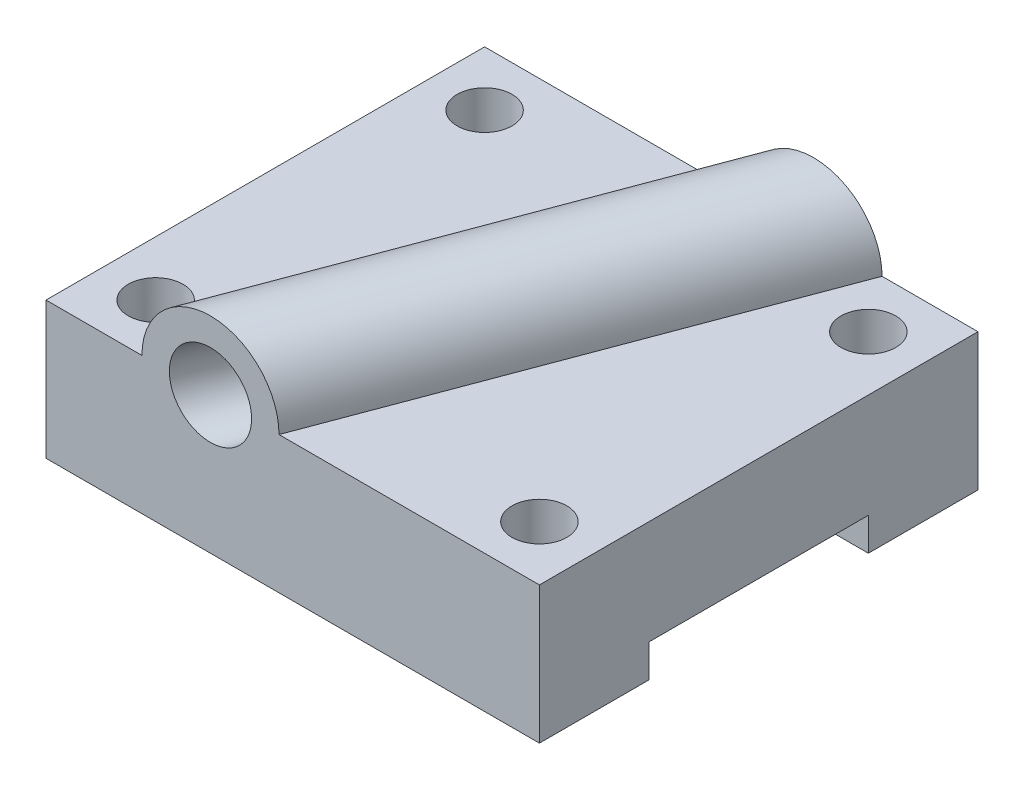
ISO-10303-21;
HEADER;
FILE_DESCRIPTION(('STEP AP214'),'2;1');
FILE_NAME('part.step','',(''),(''),'','','');
FILE_SCHEMA(('AUTOMOTIVE_DESIGN { 1 0 10303 214 1 1 1 1 }'));
ENDSEC;
DATA;
#1=APPLICATION_CONTEXT('core data for automotive mechanical design processes');
#2=APPLICATION_PROTOCOL_DEFINITION('international standard','automotive_design',2000,#1);
#3=PRODUCT_CONTEXT('',#1,'mechanical');
#4=PRODUCT('Part','Part','',(#3));
#5=PRODUCT_RELATED_PRODUCT_CATEGORY('part','',(#4));
#6=PRODUCT_DEFINITION_FORMATION('','',#4);
#7=PRODUCT_DEFINITION_CONTEXT('part definition',#1,'design');
#8=PRODUCT_DEFINITION('design','',#6,#7);
#9=PRODUCT_DEFINITION_SHAPE('','',#8);
#10=(LENGTH_UNIT() NAMED_UNIT(*) SI_UNIT(.MILLI.,.METRE.));
#11=(NAMED_UNIT(*) PLANE_ANGLE_UNIT() SI_UNIT($,.RADIAN.));
#12=(NAMED_UNIT(*) SI_UNIT($,.STERADIAN.) SOLID_ANGLE_UNIT());
#13=UNCERTAINTY_MEASURE_WITH_UNIT(LENGTH_MEASURE(1.E-05),#10,'distance_accuracy_value','');
#14=(GEOMETRIC_REPRESENTATION_CONTEXT(3) GLOBAL_UNCERTAINTY_ASSIGNED_CONTEXT((#13)) GLOBAL_UNIT_ASSIGNED_CONTEXT((#10,
#11,#12)) REPRESENTATION_CONTEXT('',''));
#15=CARTESIAN_POINT('',(0.,0.,0.));
#16=DIRECTION('',(0.,0.,1.));
#17=DIRECTION('',(1.,0.,0.));
#18=AXIS2_PLACEMENT_3D('',#15,#16,#17);
#19=CARTESIAN_POINT('',(90.,25.,40.));
#20=DIRECTION('',(0.,-1.,0.));
#21=DIRECTION('',(0.,0.,-1.));
#22=AXIS2_PLACEMENT_3D('',#19,#20,#21);
#23=PLANE('',#22);
#24=CARTESIAN_POINT('',(10.,25.,-29.9999999999999));
#25=DIRECTION('',(0.,1.,0.));
#26=DIRECTION('',(0.,0.,1.));
#27=AXIS2_PLACEMENT_3D('',#24,#25,#26);
#28=CIRCLE('',#27,5.);
#29=CARTESIAN_POINT('',(10.,25.,-24.9999999999999));
#30=VERTEX_POINT('',#29);
#31=EDGE_CURVE('E257',#30,#30,#28,.T.);
#32=ORIENTED_EDGE('',*,*,#31,.F.);
#33=EDGE_LOOP('',(#32));
#34=FACE_BOUND('',#33,.T.);
#35=CARTESIAN_POINT('',(10.,25.,29.9999999999999));
#36=DIRECTION('',(0.,1.,0.));
#37=DIRECTION('',(0.,0.,-1.));
#38=AXIS2_PLACEMENT_3D('',#35,#36,#37);
#39=CIRCLE('',#38,5.);
#40=CARTESIAN_POINT('',(10.,25.,24.9999999999999));
#41=VERTEX_POINT('',#40);
#42=EDGE_CURVE('E266',#41,#41,#39,.T.);
#43=ORIENTED_EDGE('',*,*,#42,.F.);
#44=EDGE_LOOP('',(#43));
#45=FACE_BOUND('',#44,.T.);
#46=DIRECTION('',(-1.,0.,0.));
#47=VECTOR('',#46,1.);
#48=CARTESIAN_POINT('',(90.,25.,40.));
#49=LINE('',#48,#47);
#50=CARTESIAN_POINT('',(17.5000000000001,25.,40.));
#51=VERTEX_POINT('',#50);
#52=CARTESIAN_POINT('',(0.,25.,40.));
#53=VERTEX_POINT('',#52);
#54=EDGE_CURVE('E173',#51,#53,#49,.T.);
#55=ORIENTED_EDGE('',*,*,#54,.F.);
#56=DIRECTION('',(0.351123441588392,0.,-0.936329177569045));
#57=VECTOR('',#56,1.);
#58=CARTESIAN_POINT('',(17.5,25.,40.));
#59=LINE('',#58,#57);
#60=CARTESIAN_POINT('',(47.5,25.,-40.));
#61=VERTEX_POINT('',#60);
#62=EDGE_CURVE('E245',#51,#61,#59,.T.);
#63=ORIENTED_EDGE('',*,*,#62,.T.);
#64=DIRECTION('',(-1.,0.,0.));
#65=VECTOR('',#64,1.);
#66=CARTESIAN_POINT('',(90.,25.,-40.));
#67=LINE('',#66,#65);
#68=CARTESIAN_POINT('',(0.,25.,-40.));
#69=VERTEX_POINT('',#68);
#70=EDGE_CURVE('E172',#61,#69,#67,.T.);
#71=ORIENTED_EDGE('',*,*,#70,.T.);
#72=DIRECTION('',(0.,0.,1.));
#73=VECTOR('',#72,1.);
#74=CARTESIAN_POINT('',(0.,25.,40.));
#75=LINE('',#74,#73);
#76=EDGE_CURVE('E202',#69,#53,#75,.T.);
#77=ORIENTED_EDGE('',*,*,#76,.T.);
#78=EDGE_LOOP('',(#55,#63,#71,#77));
#79=FACE_BOUND('',#78,.T.);
#80=ADVANCED_FACE('F67',(#34,#45,#79),#23,.F.);
#81=CARTESIAN_POINT('',(90.,0.,20.));
#82=DIRECTION('',(0.,0.,1.));
#83=DIRECTION('',(1.,0.,0.));
#84=AXIS2_PLACEMENT_3D('',#81,#82,#83);
#85=PLANE('',#84);
#86=DIRECTION('',(0.,1.,0.));
#87=VECTOR('',#86,1.);
#88=CARTESIAN_POINT('',(0.,0.,20.));
#89=LINE('',#88,#87);
#90=CARTESIAN_POINT('',(0.,0.,20.));
#91=VERTEX_POINT('',#90);
#92=CARTESIAN_POINT('',(0.,6.,20.));
#93=VERTEX_POINT('',#92);
#94=EDGE_CURVE('E184',#91,#93,#89,.T.);
#95=ORIENTED_EDGE('',*,*,#94,.T.);
#96=DIRECTION('',(-1.,0.,0.));
#97=VECTOR('',#96,1.);
#98=CARTESIAN_POINT('',(90.,6.,20.));
#99=LINE('',#98,#97);
#100=CARTESIAN_POINT('',(90.,6.,20.));
#101=VERTEX_POINT('',#100);
#102=EDGE_CURVE('E12',#101,#93,#99,.T.);
#103=ORIENTED_EDGE('',*,*,#102,.F.);
#104=DIRECTION('',(0.,1.,0.));
#105=VECTOR('',#104,1.);
#106=CARTESIAN_POINT('',(90.,0.,20.));
#107=LINE('',#106,#105);
#108=CARTESIAN_POINT('',(90.,0.,20.));
#109=VERTEX_POINT('',#108);
#110=EDGE_CURVE('E211',#109,#101,#107,.T.);
#111=ORIENTED_EDGE('',*,*,#110,.F.);
#112=DIRECTION('',(-1.,0.,0.));
#113=VECTOR('',#112,1.);
#114=CARTESIAN_POINT('',(90.,0.,20.));
#115=LINE('',#114,#113);
#116=EDGE_CURVE('E180',#109,#91,#115,.T.);
#117=ORIENTED_EDGE('',*,*,#116,.T.);
#118=EDGE_LOOP('',(#95,#103,#111,#117));
#119=FACE_BOUND('',#118,.T.);
#120=ADVANCED_FACE('F69',(#119),#85,.F.);
#121=CARTESIAN_POINT('',(90.,6.,20.));
#122=DIRECTION('',(0.,1.,0.));
#123=DIRECTION('',(0.,0.,1.));
#124=AXIS2_PLACEMENT_3D('',#121,#122,#123);
#125=PLANE('',#124);
#126=DIRECTION('',(0.,0.,-1.));
#127=VECTOR('',#126,1.);
#128=CARTESIAN_POINT('',(0.,6.,20.));
#129=LINE('',#128,#127);
#130=CARTESIAN_POINT('',(0.,6.,-20.));
#131=VERTEX_POINT('',#130);
#132=EDGE_CURVE('E188',#93,#131,#129,.T.);
#133=ORIENTED_EDGE('',*,*,#132,.T.);
#134=DIRECTION('',(-1.,0.,0.));
#135=VECTOR('',#134,1.);
#136=CARTESIAN_POINT('',(90.,6.,-20.));
#137=LINE('',#136,#135);
#138=CARTESIAN_POINT('',(90.,6.,-20.));
#139=VERTEX_POINT('',#138);
#140=EDGE_CURVE('E79',#139,#131,#137,.T.);
#141=ORIENTED_EDGE('',*,*,#140,.F.);
#142=DIRECTION('',(0.,0.,-1.));
#143=VECTOR('',#142,1.);
#144=CARTESIAN_POINT('',(90.,6.,20.));
#145=LINE('',#144,#143);
#146=EDGE_CURVE('E137',#101,#139,#145,.T.);
#147=ORIENTED_EDGE('',*,*,#146,.F.);
#148=ORIENTED_EDGE('',*,*,#102,.T.);
#149=EDGE_LOOP('',(#133,#141,#147,#148));
#150=FACE_BOUND('',#149,.T.);
#151=ADVANCED_FACE('F427',(#150),#125,.F.);
#152=CARTESIAN_POINT('',(90.,6.,-20.));
#153=DIRECTION('',(0.,0.,-1.));
#154=DIRECTION('',(-1.,0.,0.));
#155=AXIS2_PLACEMENT_3D('',#152,#153,#154);
#156=PLANE('',#155);
#157=DIRECTION('',(0.,-1.,0.));
#158=VECTOR('',#157,1.);
#159=CARTESIAN_POINT('',(0.,6.,-20.));
#160=LINE('',#159,#158);
#161=CARTESIAN_POINT('',(0.,0.,-20.));
#162=VERTEX_POINT('',#161);
#163=EDGE_CURVE('E192',#131,#162,#160,.T.);
#164=ORIENTED_EDGE('',*,*,#163,.T.);
#165=DIRECTION('',(-1.,0.,0.));
#166=VECTOR('',#165,1.);
#167=CARTESIAN_POINT('',(90.,0.,-20.));
#168=LINE('',#167,#166);
#169=CARTESIAN_POINT('',(90.,0.,-20.));
#170=VERTEX_POINT('',#169);
#171=EDGE_CURVE('E227',#170,#162,#168,.T.);
#172=ORIENTED_EDGE('',*,*,#171,.F.);
#173=DIRECTION('',(0.,-1.,0.));
#174=VECTOR('',#173,1.);
#175=CARTESIAN_POINT('',(90.,6.,-20.));
#176=LINE('',#175,#174);
#177=EDGE_CURVE('E292',#139,#170,#176,.T.);
#178=ORIENTED_EDGE('',*,*,#177,.F.);
#179=ORIENTED_EDGE('',*,*,#140,.T.);
#180=EDGE_LOOP('',(#164,#172,#178,#179));
#181=FACE_BOUND('',#180,.T.);
#182=ADVANCED_FACE('F424',(#181),#156,.F.);
#183=CARTESIAN_POINT('',(90.,0.,-20.));
#184=DIRECTION('',(0.,1.,0.));
#185=DIRECTION('',(0.,0.,1.));
#186=AXIS2_PLACEMENT_3D('',#183,#184,#185);
#187=PLANE('',#186);
#188=CARTESIAN_POINT('',(79.9999999999999,0.,-30.));
#189=DIRECTION('',(0.,1.,0.));
#190=DIRECTION('',(0.,0.,1.));
#191=AXIS2_PLACEMENT_3D('',#188,#189,#190);
#192=CIRCLE('',#191,5.);
#193=CARTESIAN_POINT('',(79.9999999999999,0.,-25.));
#194=VERTEX_POINT('',#193);
#195=EDGE_CURVE('E271',#194,#194,#192,.F.);
#196=ORIENTED_EDGE('',*,*,#195,.F.);
#197=EDGE_LOOP('',(#196));
#198=FACE_BOUND('',#197,.T.);
#199=CARTESIAN_POINT('',(10.,0.,-29.9999999999999));
#200=DIRECTION('',(0.,1.,0.));
#201=DIRECTION('',(0.,0.,1.));
#202=AXIS2_PLACEMENT_3D('',#199,#200,#201);
#203=CIRCLE('',#202,5.);
#204=CARTESIAN_POINT('',(10.,0.,-24.9999999999999));
#205=VERTEX_POINT('',#204);
#206=EDGE_CURVE('E261',#205,#205,#203,.F.);
#207=ORIENTED_EDGE('',*,*,#206,.F.);
#208=EDGE_LOOP('',(#207));
#209=FACE_BOUND('',#208,.T.);
#210=DIRECTION('',(0.,0.,-1.));
#211=VECTOR('',#210,1.);
#212=CARTESIAN_POINT('',(0.,0.,-20.));
#213=LINE('',#212,#211);
#214=CARTESIAN_POINT('',(0.,0.,-40.));
#215=VERTEX_POINT('',#214);
#216=EDGE_CURVE('E195',#162,#215,#213,.T.);
#217=ORIENTED_EDGE('',*,*,#216,.T.);
#218=DIRECTION('',(-1.,0.,0.));
#219=VECTOR('',#218,1.);
#220=CARTESIAN_POINT('',(90.,0.,-40.));
#221=LINE('',#220,#219);
#222=CARTESIAN_POINT('',(90.,0.,-40.));
#223=VERTEX_POINT('',#222);
#224=EDGE_CURVE('E230',#223,#215,#221,.T.);
#225=ORIENTED_EDGE('',*,*,#224,.F.);
#226=DIRECTION('',(0.,0.,-1.));
#227=VECTOR('',#226,1.);
#228=CARTESIAN_POINT('',(90.,0.,-20.));
#229=LINE('',#228,#227);
#230=EDGE_CURVE('E295',#170,#223,#229,.T.);
#231=ORIENTED_EDGE('',*,*,#230,.F.);
#232=ORIENTED_EDGE('',*,*,#171,.T.);
#233=EDGE_LOOP('',(#217,#225,#231,#232));
#234=FACE_BOUND('',#233,.T.);
#235=ADVANCED_FACE('F404',(#198,#209,#234),#187,.F.);
#236=CARTESIAN_POINT('',(90.,25.,-40.));
#237=DIRECTION('',(0.,0.,1.));
#238=DIRECTION('',(0.,-1.,0.));
#239=AXIS2_PLACEMENT_3D('',#236,#237,#238);
#240=PLANE('',#239);
#241=CARTESIAN_POINT('',(60.,25.,-40.));
#242=DIRECTION('',(0.,0.,-1.));
#243=DIRECTION('',(0.,1.,0.));
#244=AXIS2_PLACEMENT_3D('',#241,#242,#243);
#245=CIRCLE('',#244,7.5);
#246=CARTESIAN_POINT('',(66.4746739773955,28.7853133141707,-40.));
#247=VERTEX_POINT('',#246);
#248=EDGE_CURVE('E308',#247,#247,#245,.T.);
#249=ORIENTED_EDGE('',*,*,#248,.F.);
#250=EDGE_LOOP('',(#249));
#251=FACE_BOUND('',#250,.T.);
#252=DIRECTION('',(0.,1.,0.));
#253=VECTOR('',#252,1.);
#254=CARTESIAN_POINT('',(0.,25.,-40.));
#255=LINE('',#254,#253);
#256=EDGE_CURVE('E198',#215,#69,#255,.T.);
#257=ORIENTED_EDGE('',*,*,#256,.T.);
#258=ORIENTED_EDGE('',*,*,#70,.F.);
#259=CARTESIAN_POINT('',(60.,25.,-40.));
#260=DIRECTION('',(0.,0.,-1.));
#261=DIRECTION('',(0.,1.,0.));
#262=AXIS2_PLACEMENT_3D('',#259,#260,#261);
#263=CIRCLE('',#262,12.5);
#264=CARTESIAN_POINT('',(72.5,25.,-40.));
#265=VERTEX_POINT('',#264);
#266=EDGE_CURVE('E247',#61,#265,#263,.T.);
#267=ORIENTED_EDGE('',*,*,#266,.T.);
#268=CARTESIAN_POINT('',(90.,25.,-40.));
#269=VERTEX_POINT('',#268);
#270=EDGE_CURVE('E233',#269,#265,#67,.T.);
#271=ORIENTED_EDGE('',*,*,#270,.F.);
#272=DIRECTION('',(0.,1.,0.));
#273=VECTOR('',#272,1.);
#274=CARTESIAN_POINT('',(90.,25.,-40.));
#275=LINE('',#274,#273);
#276=EDGE_CURVE('E159',#223,#269,#275,.T.);
#277=ORIENTED_EDGE('',*,*,#276,.F.);
#278=ORIENTED_EDGE('',*,*,#224,.T.);
#279=EDGE_LOOP('',(#257,#258,#267,#271,#277,#278));
#280=FACE_BOUND('',#279,.T.);
#281=ADVANCED_FACE('F402',(#251,#280),#240,.F.);
#282=CARTESIAN_POINT('',(79.9999999999999,25.,-30.));
#283=DIRECTION('',(0.,1.,0.));
#284=DIRECTION('',(0.,0.,-1.));
#285=AXIS2_PLACEMENT_3D('',#282,#283,#284);
#286=CIRCLE('',#285,5.);
#287=CARTESIAN_POINT('',(79.9999999999999,25.,-35.));
#288=VERTEX_POINT('',#287);
#289=EDGE_CURVE('E265',#288,#288,#286,.T.);
#290=ORIENTED_EDGE('',*,*,#289,.F.);
#291=EDGE_LOOP('',(#290));
#292=FACE_BOUND('',#291,.T.);
#293=CARTESIAN_POINT('',(80.,25.,30.));
#294=DIRECTION('',(0.,1.,0.));
#295=DIRECTION('',(0.,0.,1.));
#296=AXIS2_PLACEMENT_3D('',#293,#294,#295);
#297=CIRCLE('',#296,5.);
#298=CARTESIAN_POINT('',(80.,25.,35.));
#299=VERTEX_POINT('',#298);
#300=EDGE_CURVE('E275',#299,#299,#297,.T.);
#301=ORIENTED_EDGE('',*,*,#300,.F.);
#302=EDGE_LOOP('',(#301));
#303=FACE_BOUND('',#302,.T.);
#304=ORIENTED_EDGE('',*,*,#270,.T.);
#305=DIRECTION('',(0.351123441588392,0.,-0.936329177569045));
#306=VECTOR('',#305,1.);
#307=CARTESIAN_POINT('',(42.5,25.,40.));
#308=LINE('',#307,#306);
#309=CARTESIAN_POINT('',(42.5,25.,40.));
#310=VERTEX_POINT('',#309);
#311=EDGE_CURVE('E170',#310,#265,#308,.T.);
#312=ORIENTED_EDGE('',*,*,#311,.F.);
#313=CARTESIAN_POINT('',(90.,25.,40.));
#314=VERTEX_POINT('',#313);
#315=EDGE_CURVE('E166',#314,#310,#49,.T.);
#316=ORIENTED_EDGE('',*,*,#315,.F.);
#317=DIRECTION('',(0.,0.,1.));
#318=VECTOR('',#317,1.);
#319=CARTESIAN_POINT('',(90.,25.,40.));
#320=LINE('',#319,#318);
#321=EDGE_CURVE('E152',#269,#314,#320,.T.);
#322=ORIENTED_EDGE('',*,*,#321,.F.);
#323=EDGE_LOOP('',(#304,#312,#316,#322));
#324=FACE_BOUND('',#323,.T.);
#325=ADVANCED_FACE('F167',(#292,#303,#324),#23,.F.);
#326=CARTESIAN_POINT('',(90.,0.,40.));
#327=DIRECTION('',(0.,0.,-1.));
#328=DIRECTION('',(0.,1.,0.));
#329=AXIS2_PLACEMENT_3D('',#326,#327,#328);
#330=PLANE('',#329);
#331=CARTESIAN_POINT('',(30.,25.,40.));
#332=DIRECTION('',(0.,0.,1.));
#333=DIRECTION('',(1.,0.,0.));
#334=AXIS2_PLACEMENT_3D('',#331,#332,#333);
#335=CIRCLE('',#334,7.5);
#336=CARTESIAN_POINT('',(29.9717257330912,32.4999467041994,40.));
#337=VERTEX_POINT('',#336);
#338=EDGE_CURVE('E246',#337,#337,#335,.T.);
#339=ORIENTED_EDGE('',*,*,#338,.F.);
#340=EDGE_LOOP('',(#339));
#341=FACE_BOUND('',#340,.T.);
#342=DIRECTION('',(0.,-1.,0.));
#343=VECTOR('',#342,1.);
#344=CARTESIAN_POINT('',(0.,0.,40.));
#345=LINE('',#344,#343);
#346=CARTESIAN_POINT('',(0.,0.,40.));
#347=VERTEX_POINT('',#346);
#348=EDGE_CURVE('E206',#53,#347,#345,.T.);
#349=ORIENTED_EDGE('',*,*,#348,.T.);
#350=DIRECTION('',(-1.,0.,0.));
#351=VECTOR('',#350,1.);
#352=CARTESIAN_POINT('',(90.,0.,40.));
#353=LINE('',#352,#351);
#354=CARTESIAN_POINT('',(90.,0.,40.));
#355=VERTEX_POINT('',#354);
#356=EDGE_CURVE('E176',#355,#347,#353,.T.);
#357=ORIENTED_EDGE('',*,*,#356,.F.);
#358=DIRECTION('',(0.,-1.,0.));
#359=VECTOR('',#358,1.);
#360=CARTESIAN_POINT('',(90.,0.,40.));
#361=LINE('',#360,#359);
#362=EDGE_CURVE('E156',#314,#355,#361,.T.);
#363=ORIENTED_EDGE('',*,*,#362,.F.);
#364=ORIENTED_EDGE('',*,*,#315,.T.);
#365=CARTESIAN_POINT('',(30.,25.,40.));
#366=DIRECTION('',(0.,0.,1.));
#367=DIRECTION('',(1.,0.,0.));
#368=AXIS2_PLACEMENT_3D('',#365,#366,#367);
#369=CIRCLE('',#368,12.5);
#370=EDGE_CURVE('E87',#310,#51,#369,.T.);
#371=ORIENTED_EDGE('',*,*,#370,.T.);
#372=ORIENTED_EDGE('',*,*,#54,.T.);
#373=EDGE_LOOP('',(#349,#357,#363,#364,#371,#372));
#374=FACE_BOUND('',#373,.T.);
#375=ADVANCED_FACE('F175',(#341,#374),#330,.F.);
#376=CARTESIAN_POINT('',(90.,0.,40.));
#377=DIRECTION('',(0.,1.,0.));
#378=DIRECTION('',(0.,0.,1.));
#379=AXIS2_PLACEMENT_3D('',#376,#377,#378);
#380=PLANE('',#379);
#381=CARTESIAN_POINT('',(10.,0.,29.9999999999999));
#382=DIRECTION('',(0.,1.,0.));
#383=DIRECTION('',(0.,0.,1.));
#384=AXIS2_PLACEMENT_3D('',#381,#382,#383);
#385=CIRCLE('',#384,5.);
#386=CARTESIAN_POINT('',(10.,0.,35.));
#387=VERTEX_POINT('',#386);
#388=EDGE_CURVE('E270',#387,#387,#385,.F.);
#389=ORIENTED_EDGE('',*,*,#388,.F.);
#390=EDGE_LOOP('',(#389));
#391=FACE_BOUND('',#390,.T.);
#392=CARTESIAN_POINT('',(80.,0.,30.));
#393=DIRECTION('',(0.,1.,0.));
#394=DIRECTION('',(0.,0.,1.));
#395=AXIS2_PLACEMENT_3D('',#392,#393,#394);
#396=CIRCLE('',#395,5.);
#397=CARTESIAN_POINT('',(80.,0.,35.));
#398=VERTEX_POINT('',#397);
#399=EDGE_CURVE('E189',#398,#398,#396,.F.);
#400=ORIENTED_EDGE('',*,*,#399,.F.);
#401=EDGE_LOOP('',(#400));
#402=FACE_BOUND('',#401,.T.);
#403=DIRECTION('',(0.,0.,-1.));
#404=VECTOR('',#403,1.);
#405=CARTESIAN_POINT('',(0.,0.,40.));
#406=LINE('',#405,#404);
#407=EDGE_CURVE('E129',#347,#91,#406,.T.);
#408=ORIENTED_EDGE('',*,*,#407,.T.);
#409=ORIENTED_EDGE('',*,*,#116,.F.);
#410=DIRECTION('',(0.,0.,-1.));
#411=VECTOR('',#410,1.);
#412=CARTESIAN_POINT('',(90.,0.,40.));
#413=LINE('',#412,#411);
#414=EDGE_CURVE('E97',#355,#109,#413,.T.);
#415=ORIENTED_EDGE('',*,*,#414,.F.);
#416=ORIENTED_EDGE('',*,*,#356,.T.);
#417=EDGE_LOOP('',(#408,#409,#415,#416));
#418=FACE_BOUND('',#417,.T.);
#419=ADVANCED_FACE('F374',(#391,#402,#418),#380,.F.);
#420=CARTESIAN_POINT('',(90.,0.,0.));
#421=DIRECTION('',(-1.,0.,0.));
#422=DIRECTION('',(0.,0.,1.));
#423=AXIS2_PLACEMENT_3D('',#420,#421,#422);
#424=PLANE('',#423);
#425=ORIENTED_EDGE('',*,*,#110,.T.);
#426=ORIENTED_EDGE('',*,*,#146,.T.);
#427=ORIENTED_EDGE('',*,*,#177,.T.);
#428=ORIENTED_EDGE('',*,*,#230,.T.);
#429=ORIENTED_EDGE('',*,*,#276,.T.);
#430=ORIENTED_EDGE('',*,*,#321,.T.);
#431=ORIENTED_EDGE('',*,*,#362,.T.);
#432=ORIENTED_EDGE('',*,*,#414,.T.);
#433=EDGE_LOOP('',(#425,#426,#427,#428,#429,#430,#431,#432));
#434=FACE_BOUND('',#433,.T.);
#435=ADVANCED_FACE('F154',(#434),#424,.F.);
#436=CARTESIAN_POINT('',(0.,0.,0.));
#437=DIRECTION('',(-1.,0.,0.));
#438=DIRECTION('',(0.,0.,1.));
#439=AXIS2_PLACEMENT_3D('',#436,#437,#438);
#440=PLANE('',#439);
#441=ORIENTED_EDGE('',*,*,#94,.F.);
#442=ORIENTED_EDGE('',*,*,#407,.F.);
#443=ORIENTED_EDGE('',*,*,#348,.F.);
#444=ORIENTED_EDGE('',*,*,#76,.F.);
#445=ORIENTED_EDGE('',*,*,#256,.F.);
#446=ORIENTED_EDGE('',*,*,#216,.F.);
#447=ORIENTED_EDGE('',*,*,#163,.F.);
#448=ORIENTED_EDGE('',*,*,#132,.F.);
#449=EDGE_LOOP('',(#441,#442,#443,#444,#445,#446,#447,#448));
#450=FACE_BOUND('',#449,.T.);
#451=ADVANCED_FACE('F370',(#450),#440,.T.);
#452=CARTESIAN_POINT('',(80.,-0.00100000000001488,30.));
#453=DIRECTION('',(0.,1.,0.));
#454=DIRECTION('',(0.,0.,1.));
#455=AXIS2_PLACEMENT_3D('',#452,#453,#454);
#456=CYLINDRICAL_SURFACE('',#455,5.);
#457=ORIENTED_EDGE('',*,*,#300,.T.);
#458=EDGE_LOOP('',(#457));
#459=FACE_BOUND('',#458,.T.);
#460=ORIENTED_EDGE('',*,*,#399,.T.);
#461=EDGE_LOOP('',(#460));
#462=FACE_BOUND('',#461,.T.);
#463=ADVANCED_FACE('F363',(#459,#462),#456,.F.);
#464=CARTESIAN_POINT('',(10.,-0.00100000000001141,29.9999999999999));
#465=DIRECTION('',(0.,1.,0.));
#466=DIRECTION('',(0.,0.,1.));
#467=AXIS2_PLACEMENT_3D('',#464,#465,#466);
#468=CYLINDRICAL_SURFACE('',#467,5.);
#469=ORIENTED_EDGE('',*,*,#42,.T.);
#470=EDGE_LOOP('',(#469));
#471=FACE_BOUND('',#470,.T.);
#472=ORIENTED_EDGE('',*,*,#388,.T.);
#473=EDGE_LOOP('',(#472));
#474=FACE_BOUND('',#473,.T.);
#475=ADVANCED_FACE('F359',(#471,#474),#468,.F.);
#476=CARTESIAN_POINT('',(10.,-0.00100000000000447,-29.9999999999999));
#477=DIRECTION('',(0.,1.,0.));
#478=DIRECTION('',(0.,0.,1.));
#479=AXIS2_PLACEMENT_3D('',#476,#477,#478);
#480=CYLINDRICAL_SURFACE('',#479,5.);
#481=ORIENTED_EDGE('',*,*,#31,.T.);
#482=EDGE_LOOP('',(#481));
#483=FACE_BOUND('',#482,.T.);
#484=ORIENTED_EDGE('',*,*,#206,.T.);
#485=EDGE_LOOP('',(#484));
#486=FACE_BOUND('',#485,.T.);
#487=ADVANCED_FACE('F350',(#483,#486),#480,.F.);
#488=CARTESIAN_POINT('',(79.9999999999999,-0.001000000000001,-30.));
#489=DIRECTION('',(0.,1.,0.));
#490=DIRECTION('',(0.,0.,1.));
#491=AXIS2_PLACEMENT_3D('',#488,#489,#490);
#492=CYLINDRICAL_SURFACE('',#491,5.);
#493=ORIENTED_EDGE('',*,*,#289,.T.);
#494=EDGE_LOOP('',(#493));
#495=FACE_BOUND('',#494,.T.);
#496=ORIENTED_EDGE('',*,*,#195,.T.);
#497=EDGE_LOOP('',(#496));
#498=FACE_BOUND('',#497,.T.);
#499=ADVANCED_FACE('F346',(#495,#498),#492,.F.);
#500=CARTESIAN_POINT('',(17.5,25.,40.));
#501=CARTESIAN_POINT('',(47.5,25.,-40.));
#502=CARTESIAN_POINT('',(17.5,25.5208333333333,40.));
#503=CARTESIAN_POINT('',(47.5,25.5208333333333,-40.));
#504=CARTESIAN_POINT('',(17.5323048006892,26.0745425118125,40.));
#505=CARTESIAN_POINT('',(47.5323048006892,26.0745425118125,-40.));
#506=CARTESIAN_POINT('',(17.6889341373639,27.244041558984,40.));
#507=CARTESIAN_POINT('',(47.6889341373639,27.244041558984,-40.));
#508=CARTESIAN_POINT('',(17.8133333333333,27.86,40.));
#509=CARTESIAN_POINT('',(47.8133333333333,27.86,-40.));
#510=CARTESIAN_POINT('',(18.1866666666667,29.14,40.));
#511=CARTESIAN_POINT('',(48.1866666666667,29.14,-40.));
#512=CARTESIAN_POINT('',(18.4358035601565,29.8042124310904,40.));
#513=CARTESIAN_POINT('',(48.4358035601566,29.8042124310904,-40.));
#514=CARTESIAN_POINT('',(19.0922863274839,31.1508437486849,40.));
#515=CARTESIAN_POINT('',(49.0922863274839,31.1508437486849,-40.));
#516=CARTESIAN_POINT('',(19.5,31.8333333333333,40.));
#517=CARTESIAN_POINT('',(49.5,31.8333333333334,-40.));
#518=CARTESIAN_POINT('',(20.5,33.1666666666667,40.));
#519=CARTESIAN_POINT('',(50.5,33.1666666666667,-40.));
#520=CARTESIAN_POINT('',(21.0927628698317,33.8173203227622,40.));
#521=CARTESIAN_POINT('',(51.0927628698317,33.8173203227622,-40.));
#522=CARTESIAN_POINT('',(22.4688809657847,35.0182961155939,40.));
#523=CARTESIAN_POINT('',(52.4688809657847,35.0182961155939,-40.));
#524=CARTESIAN_POINT('',(23.2525951557094,35.5680507497117,40.));
#525=CARTESIAN_POINT('',(53.2525951557093,35.5680507497117,-40.));
#526=CARTESIAN_POINT('',(24.9826989619377,36.4907727797001,40.));
#527=CARTESIAN_POINT('',(54.9826989619377,36.4907727797001,-40.));
#528=CARTESIAN_POINT('',(25.9289940828402,36.8629191321499,40.));
#529=CARTESIAN_POINT('',(55.9289940828402,36.8629191321499,-40.));
#530=CARTESIAN_POINT('',(27.9171597633136,37.3678500986193,40.));
#531=CARTESIAN_POINT('',(57.9171597633136,37.3678500986193,-40.));
#532=CARTESIAN_POINT('',(28.9583333333333,37.5,40.));
#533=CARTESIAN_POINT('',(58.9583333333333,37.5,-40.));
#534=CARTESIAN_POINT('',(31.0416666666667,37.5,40.));
#535=CARTESIAN_POINT('',(61.0416666666667,37.5,-40.));
#536=CARTESIAN_POINT('',(32.0828402366864,37.3678500986193,40.));
#537=CARTESIAN_POINT('',(62.0828402366864,37.3678500986193,-40.));
#538=CARTESIAN_POINT('',(34.0710059171598,36.8629191321499,40.));
#539=CARTESIAN_POINT('',(64.0710059171598,36.8629191321499,-40.));
#540=CARTESIAN_POINT('',(35.0173010380623,36.4907727797001,40.));
#541=CARTESIAN_POINT('',(65.0173010380623,36.4907727797001,-40.));
#542=CARTESIAN_POINT('',(36.7474048442906,35.5680507497117,40.));
#543=CARTESIAN_POINT('',(66.7474048442906,35.5680507497117,-40.));
#544=CARTESIAN_POINT('',(37.5311190342153,35.0182961155939,40.));
#545=CARTESIAN_POINT('',(67.5311190342153,35.0182961155939,-40.));
#546=CARTESIAN_POINT('',(38.9072371301683,33.8173203227622,40.));
#547=CARTESIAN_POINT('',(68.9072371301683,33.8173203227623,-40.));
#548=CARTESIAN_POINT('',(39.5,33.1666666666667,40.));
#549=CARTESIAN_POINT('',(69.5,33.1666666666667,-40.));
#550=CARTESIAN_POINT('',(40.5,31.8333333333333,40.));
#551=CARTESIAN_POINT('',(70.5,31.8333333333334,-40.));
#552=CARTESIAN_POINT('',(40.9077136725161,31.1508437486849,40.));
#553=CARTESIAN_POINT('',(70.9077136725161,31.1508437486849,-40.));
#554=CARTESIAN_POINT('',(41.5641964398435,29.8042124310904,40.));
#555=CARTESIAN_POINT('',(71.5641964398434,29.8042124310904,-40.));
#556=CARTESIAN_POINT('',(41.8133333333333,29.14,40.));
#557=CARTESIAN_POINT('',(71.8133333333333,29.14,-40.));
#558=CARTESIAN_POINT('',(42.1866666666667,27.86,40.));
#559=CARTESIAN_POINT('',(72.1866666666667,27.86,-40.));
#560=CARTESIAN_POINT('',(42.3110658626361,27.244041558984,40.));
#561=CARTESIAN_POINT('',(72.3110658626361,27.244041558984,-40.));
#562=CARTESIAN_POINT('',(42.4676951993108,26.0745425118125,40.));
#563=CARTESIAN_POINT('',(72.4676951993108,26.0745425118125,-40.));
#564=CARTESIAN_POINT('',(42.5,25.5208333333333,40.));
#565=CARTESIAN_POINT('',(72.5,25.5208333333334,-40.));
#566=CARTESIAN_POINT('',(42.5,25.,40.));
#567=CARTESIAN_POINT('',(72.5,25.,-40.));
#568=B_SPLINE_SURFACE_WITH_KNOTS('',3,1,((#500,#501),(#502,#503),(#504,#505),(#506,#507),(#508,
#509),(#510,#511),(#512,#513),(#514,#515),(#516,#517),(#518,#519),(#520,#521),(#522,#523),(#524,
#525),(#526,#527),(#528,#529),(#530,#531),(#532,#533),(#534,#535),(#536,#537),(#538,#539),(#540,
#541),(#542,#543),(#544,#545),(#546,#547),(#548,#549),(#550,#551),(#552,#553),(#554,#555),(#556,
#557),(#558,#559),(#560,#561),(#562,#563),(#564,#565),(#566,#567)),.UNSPECIFIED.,.F.,.F.,.F.,(4,
2,2,2,2,2,2,2,2,2,2,2,2,2,2,2,4),(2,2),(0.,0.0625,0.125,0.1875,0.25,0.3125,0.375,0.4375,0.5,
0.5625,0.625,0.6875,0.75,0.8125,0.875,0.9375,1.),(0.,1.),.UNSPECIFIED.);
#569=ORIENTED_EDGE('',*,*,#370,.F.);
#570=ORIENTED_EDGE('',*,*,#311,.T.);
#571=ORIENTED_EDGE('',*,*,#266,.F.);
#572=ORIENTED_EDGE('',*,*,#62,.F.);
#573=EDGE_LOOP('',(#569,#570,#571,#572));
#574=FACE_BOUND('',#573,.T.);
#575=ADVANCED_FACE('F334',(#574),#568,.T.);
#576=CARTESIAN_POINT('',(66.4746739773955,28.7853133141707,-40.));
#577=CARTESIAN_POINT('',(29.9717257330912,32.4999467041994,40.));
#578=CARTESIAN_POINT('',(66.1592312012146,29.3248694789537,-40.));
#579=CARTESIAN_POINT('',(29.3467301744079,32.4975905152903,40.));
#580=CARTESIAN_POINT('',(65.7367923031611,29.8968575709726,-40.));
#581=CARTESIAN_POINT('',(28.6400217109967,32.4189257344605,40.));
#582=CARTESIAN_POINT('',(64.8653027839172,30.7217854574257,-40.));
#583=CARTESIAN_POINT('',(27.4892965843892,32.0785851947152,40.));
#584=CARTESIAN_POINT('',(64.5351161983226,30.9903852768709,-40.));
#585=CARTESIAN_POINT('',(27.0913354907556,31.9276017112924,40.));
#586=CARTESIAN_POINT('',(63.7872815306432,31.4891057400299,-40.));
#587=CARTESIAN_POINT('',(26.2848473673011,31.5306688488538,40.));
#588=CARTESIAN_POINT('',(63.3694215292655,31.7191516248796,-40.));
#589=CARTESIAN_POINT('',(25.8762787508343,31.284498632284,40.));
#590=CARTESIAN_POINT('',(62.4476808575623,32.1069584506681,-40.));
#591=CARTESIAN_POINT('',(25.0785463770724,30.6814869741444,40.));
#592=CARTESIAN_POINT('',(61.9436109155305,32.2644766196361,-40.));
#593=CARTESIAN_POINT('',(24.6894977524313,30.3243600391761,40.));
#594=CARTESIAN_POINT('',(60.8671320607871,32.4698277046638,-40.));
#595=CARTESIAN_POINT('',(23.972030095717,29.4959785121002,40.));
#596=CARTESIAN_POINT('',(60.2947090682052,32.5172579659317,-40.));
#597=CARTESIAN_POINT('',(23.6439523747504,29.0245098268987,40.));
#598=CARTESIAN_POINT('',(59.1191370619833,32.4712851133975,-40.));
#599=CARTESIAN_POINT('',(23.0942364842778,27.9843677766264,40.));
#600=CARTESIAN_POINT('',(58.516285627024,32.3774853360936,-40.));
#601=CARTESIAN_POINT('',(22.8730907235808,27.4157529655455,40.));
#602=CARTESIAN_POINT('',(57.3335619066859,32.0369600055263,-40.));
#603=CARTESIAN_POINT('',(22.5746314107238,26.2217199098987,40.));
#604=CARTESIAN_POINT('',(56.7542428506123,31.7901167535764,-40.));
#605=CARTESIAN_POINT('',(22.4976971068916,25.5967212917745,40.));
#606=CARTESIAN_POINT('',(55.6751305210463,31.1592312012146,-40.));
#607=CARTESIAN_POINT('',(22.5024094847097,24.3467301744079,40.));
#608=CARTESIAN_POINT('',(55.1758480699587,30.7754875448511,-40.));
#609=CARTESIAN_POINT('',(22.5840539356487,23.7223293869371,40.));
#610=CARTESIAN_POINT('',(54.2989358552388,29.9118800720468,-40.));
#611=CARTESIAN_POINT('',(22.891507476843,22.5305805797569,40.));
#612=CARTESIAN_POINT('',(53.9214749071191,29.4325560861047,-40.));
#613=CARTESIAN_POINT('',(23.1169341656717,21.9636493151238,40.));
#614=CARTESIAN_POINT('',(53.3047496185603,28.4306913430207,-40.));
#615=CARTESIAN_POINT('',(23.6744768428318,20.9276815510848,40.));
#616=CARTESIAN_POINT('',(53.0652855917469,27.9086044805327,-40.));
#617=CARTESIAN_POINT('',(24.0060999948683,20.4586998913648,40.));
#618=CARTESIAN_POINT('',(52.7161778823799,26.8698072914278,-40.));
#619=CARTESIAN_POINT('',(24.7297930484374,19.6357514379077,40.));
#620=CARTESIAN_POINT('',(52.6061764119213,26.3532822131286,-40.));
#621=CARTESIAN_POINT('',(25.1215232627738,19.2815679837614,40.));
#622=CARTESIAN_POINT('',(52.4919692472412,25.3598252570728,-40.));
#623=CARTESIAN_POINT('',(25.9237795192411,18.6845881692291,40.));
#624=CARTESIAN_POINT('',(52.4874591517119,24.8828475333519,-40.));
#625=CARTESIAN_POINT('',(26.3341925845397,18.4415054554878,40.));
#626=CARTESIAN_POINT('',(52.5552119169557,23.9865281966428,-40.));
#627=CARTESIAN_POINT('',(27.1436505590317,18.0506645951775,40.));
#628=CARTESIAN_POINT('',(52.6273056767761,23.5670385852011,-40.));
#629=CARTESIAN_POINT('',(27.5427387187491,17.9026859308845,40.));
#630=CARTESIAN_POINT('',(52.9186644076454,22.4029466257983,-40.));
#631=CARTESIAN_POINT('',(28.6959972196716,17.5710312459335,40.));
#632=CARTESIAN_POINT('',(53.2098832464237,21.7542428506122,-40.));
#633=CARTESIAN_POINT('',(29.4032787082255,17.4976971068916,40.));
#634=CARTESIAN_POINT('',(53.8407687987854,20.6751305210463,-40.));
#635=CARTESIAN_POINT('',(30.6532698255921,17.5024094847097,40.));
#636=CARTESIAN_POINT('',(54.2632076968389,20.1031424290275,-40.));
#637=CARTESIAN_POINT('',(31.3599782890033,17.5810742655395,40.));
#638=CARTESIAN_POINT('',(55.1346972160828,19.2782145425744,-40.));
#639=CARTESIAN_POINT('',(32.5107034156108,17.9214148052849,40.));
#640=CARTESIAN_POINT('',(55.4648838016774,19.0096147231292,-40.));
#641=CARTESIAN_POINT('',(32.9086645092444,18.0723982887076,40.));
#642=CARTESIAN_POINT('',(56.2127184693568,18.5108942599702,-40.));
#643=CARTESIAN_POINT('',(33.7151526326989,18.4693311511462,40.));
#644=CARTESIAN_POINT('',(56.6305784707345,18.2808483751204,-40.));
#645=CARTESIAN_POINT('',(34.1237212491657,18.715501367716,40.));
#646=CARTESIAN_POINT('',(57.5523191424377,17.8930415493319,-40.));
#647=CARTESIAN_POINT('',(34.9214536229276,19.3185130258556,40.));
#648=CARTESIAN_POINT('',(58.0563890844695,17.735523380364,-40.));
#649=CARTESIAN_POINT('',(35.3105022475687,19.6756399608239,40.));
#650=CARTESIAN_POINT('',(59.1328679392129,17.5301722953362,-40.));
#651=CARTESIAN_POINT('',(36.027969904283,20.5040214878998,40.));
#652=CARTESIAN_POINT('',(59.7052909317947,17.4827420340683,-40.));
#653=CARTESIAN_POINT('',(36.3560476252496,20.9754901731013,40.));
#654=CARTESIAN_POINT('',(60.8808629380167,17.5287148866026,-40.));
#655=CARTESIAN_POINT('',(36.9057635157222,22.0156322233736,40.));
#656=CARTESIAN_POINT('',(61.483714372976,17.6225146639064,-40.));
#657=CARTESIAN_POINT('',(37.1269092764192,22.5842470344545,40.));
#658=CARTESIAN_POINT('',(62.6664380933141,17.9630399944738,-40.));
#659=CARTESIAN_POINT('',(37.4253685892762,23.7782800901013,40.));
#660=CARTESIAN_POINT('',(63.2457571493877,18.2098832464237,-40.));
#661=CARTESIAN_POINT('',(37.5023028931084,24.4032787082255,40.));
#662=CARTESIAN_POINT('',(64.3248694789537,18.8407687987855,-40.));
#663=CARTESIAN_POINT('',(37.4975905152903,25.6532698255921,40.));
#664=CARTESIAN_POINT('',(64.8241519300414,19.2245124551489,-40.));
#665=CARTESIAN_POINT('',(37.4159460643513,26.2776706130629,40.));
#666=CARTESIAN_POINT('',(65.7010641447612,20.0881199279532,-40.));
#667=CARTESIAN_POINT('',(37.108492523157,27.4694194202431,40.));
#668=CARTESIAN_POINT('',(66.0785250928809,20.5674439138953,-40.));
#669=CARTESIAN_POINT('',(36.8830658343283,28.0363506848762,40.));
#670=CARTESIAN_POINT('',(66.6952503814397,21.5693086569793,-40.));
#671=CARTESIAN_POINT('',(36.3255231571681,29.0723184489152,40.));
#672=CARTESIAN_POINT('',(66.9347144082531,22.0913955194674,-40.));
#673=CARTESIAN_POINT('',(35.9939000051317,29.5413001086352,40.));
#674=CARTESIAN_POINT('',(67.2838221176201,23.1301927085723,-40.));
#675=CARTESIAN_POINT('',(35.2702069515626,30.3642485620923,40.));
#676=CARTESIAN_POINT('',(67.3938235880788,23.6467177868714,-40.));
#677=CARTESIAN_POINT('',(34.8784767372262,30.7184320162386,40.));
#678=CARTESIAN_POINT('',(67.5080307527588,24.6401747429272,-40.));
#679=CARTESIAN_POINT('',(34.0762204807589,31.3154118307709,40.));
#680=CARTESIAN_POINT('',(67.5125408482881,25.1171524666481,-40.));
#681=CARTESIAN_POINT('',(33.6658074154603,31.5584945445122,40.));
#682=CARTESIAN_POINT('',(67.4447880830443,26.0134718033572,-40.));
#683=CARTESIAN_POINT('',(32.8563494409683,31.9493354048225,40.));
#684=CARTESIAN_POINT('',(67.3726943232239,26.4329614147989,-40.));
#685=CARTESIAN_POINT('',(32.4572612812509,32.0973140691155,40.));
#686=CARTESIAN_POINT('',(67.0813355923546,27.5970533742017,-40.));
#687=CARTESIAN_POINT('',(31.3040027803284,32.4289687540665,40.));
#688=CARTESIAN_POINT('',(66.7901167535764,28.2457571493878,-40.));
#689=CARTESIAN_POINT('',(30.5967212917745,32.5023028931084,40.));
#690=CARTESIAN_POINT('',(66.4746739773955,28.7853133141707,-40.));
#691=CARTESIAN_POINT('',(29.9717257330912,32.4999467041994,40.));
#692=B_SPLINE_SURFACE_WITH_KNOTS('',3,1,((#576,#577),(#578,#579),(#580,#581),(#582,#583),(#584,
#585),(#586,#587),(#588,#589),(#590,#591),(#592,#593),(#594,#595),(#596,#597),(#598,#599),(#600,
#601),(#602,#603),(#604,#605),(#606,#607),(#608,#609),(#610,#611),(#612,#613),(#614,#615),(#616,
#617),(#618,#619),(#620,#621),(#622,#623),(#624,#625),(#626,#627),(#628,#629),(#630,#631),(#632,
#633),(#634,#635),(#636,#637),(#638,#639),(#640,#641),(#642,#643),(#644,#645),(#646,#647),(#648,
#649),(#650,#651),(#652,#653),(#654,#655),(#656,#657),(#658,#659),(#660,#661),(#662,#663),(#664,
#665),(#666,#667),(#668,#669),(#670,#671),(#672,#673),(#674,#675),(#676,#677),(#678,#679),(#680,
#681),(#682,#683),(#684,#685),(#686,#687),(#688,#689),(#690,#691)),.UNSPECIFIED.,.T.,.F.,.F.,(4,
2,2,2,2,2,2,2,2,2,2,2,2,2,2,2,2,2,2,2,2,2,2,2,2,2,2,2,4),(2,2),(0.,0.0624999999999987,
0.0937499999999981,0.124999999999998,0.156249999999998,0.187499999999998,0.218749999999998,
0.249999999999998,0.281249999999998,0.312499999999997,0.343749999999997,0.374999999999997,
0.406249999999997,0.437499999999997,0.499999999999997,0.562499999999997,0.593749999999997,
0.624999999999997,0.656249999999997,0.687499999999997,0.718749999999997,0.749999999999997,
0.781249999999998,0.812499999999998,0.843749999999998,0.874999999999999,0.906249999999999,
0.937499999999999,1.),(0.,1.),.UNSPECIFIED.);
#693=CARTESIAN_POINT('',(66.4746739773955,28.7853133141707,-40.));
#694=CARTESIAN_POINT('',(66.094434933184,28.8240074119835,-39.1666666666667));
#695=CARTESIAN_POINT('',(65.7141958889725,28.8627015097963,-38.3333333333333));
#696=CARTESIAN_POINT('',(64.9537178005495,28.9400897054219,-36.6666666666667));
#697=CARTESIAN_POINT('',(64.573478756338,28.9787838032347,-35.8333333333333));
#698=CARTESIAN_POINT('',(63.813000667915,29.0561719988603,-34.1666666666667));
#699=CARTESIAN_POINT('',(63.4327616237035,29.0948660966731,-33.3333333333333));
#700=CARTESIAN_POINT('',(62.6722835352805,29.1722542922987,-31.6666666666667));
#701=CARTESIAN_POINT('',(62.292044491069,29.2109483901115,-30.8333333333333));
#702=CARTESIAN_POINT('',(61.531566402646,29.2883365857371,-29.1666666666667));
#703=CARTESIAN_POINT('',(61.1513273584345,29.3270306835499,-28.3333333333333));
#704=CARTESIAN_POINT('',(60.3908492700114,29.4044188791755,-26.6666666666667));
#705=CARTESIAN_POINT('',(60.0106102257999,29.4431129769883,-25.8333333333333));
#706=CARTESIAN_POINT('',(59.2501321373769,29.5205011726139,-24.1666666666667));
#707=CARTESIAN_POINT('',(58.8698930931654,29.5591952704267,-23.3333333333333));
#708=CARTESIAN_POINT('',(58.1094150047424,29.6365834660523,-21.6666666666667));
#709=CARTESIAN_POINT('',(57.7291759605309,29.6752775638651,-20.8333333333333));
#710=CARTESIAN_POINT('',(56.9686978721079,29.7526657594907,-19.1666666666667));
#711=CARTESIAN_POINT('',(56.5884588278964,29.7913598573035,-18.3333333333333));
#712=CARTESIAN_POINT('',(55.8279807394734,29.8687480529291,-16.6666666666667));
#713=CARTESIAN_POINT('',(55.4477416952619,29.9074421507419,-15.8333333333333));
#714=CARTESIAN_POINT('',(54.6872636068389,29.9848303463675,-14.1666666666667));
#715=CARTESIAN_POINT('',(54.3070245626274,30.0235244441803,-13.3333333333333));
#716=CARTESIAN_POINT('',(53.5465464742044,30.1009126398059,-11.6666666666667));
#717=CARTESIAN_POINT('',(53.1663074299929,30.1396067376187,-10.8333333333333));
#718=CARTESIAN_POINT('',(52.4058293415699,30.2169949332443,-9.16666666666667));
#719=CARTESIAN_POINT('',(52.0255902973584,30.2556890310571,-8.33333333333333));
#720=CARTESIAN_POINT('',(51.2651122089354,30.3330772266827,-6.66666666666666));
#721=CARTESIAN_POINT('',(50.8848731647239,30.3717713244955,-5.83333333333333));
#722=CARTESIAN_POINT('',(50.1243950763008,30.4491595201211,-4.16666666666667));
#723=CARTESIAN_POINT('',(49.7441560320894,30.4878536179339,-3.33333333333333));
#724=CARTESIAN_POINT('',(48.9836779436663,30.5652418135595,-1.66666666666667));
#725=CARTESIAN_POINT('',(48.6034388994548,30.6039359113723,-0.833333333333332));
#726=CARTESIAN_POINT('',(47.8429608110318,30.6813241069979,0.833333333333335));
#727=CARTESIAN_POINT('',(47.4627217668203,30.7200182048107,1.66666666666667));
#728=CARTESIAN_POINT('',(46.7022436783973,30.7974064004363,3.33333333333334));
#729=CARTESIAN_POINT('',(46.3220046341858,30.8361004982491,4.16666666666667));
#730=CARTESIAN_POINT('',(45.5615265457628,30.9134886938746,5.83333333333334));
#731=CARTESIAN_POINT('',(45.1812875015513,30.9521827916874,6.66666666666667));
#732=CARTESIAN_POINT('',(44.4208094131283,31.029570987313,8.33333333333334));
#733=CARTESIAN_POINT('',(44.0405703689168,31.0682650851258,9.16666666666667));
#734=CARTESIAN_POINT('',(43.2800922804938,31.1456532807514,10.8333333333333));
#735=CARTESIAN_POINT('',(42.8998532362823,31.1843473785642,11.6666666666667));
#736=CARTESIAN_POINT('',(42.1393751478593,31.2617355741898,13.3333333333333));
#737=CARTESIAN_POINT('',(41.7591361036478,31.3004296720026,14.1666666666667));
#738=CARTESIAN_POINT('',(40.9986580152248,31.3778178676282,15.8333333333333));
#739=CARTESIAN_POINT('',(40.6184189710133,31.416511965441,16.6666666666667));
#740=CARTESIAN_POINT('',(39.8579408825903,31.4939001610666,18.3333333333333));
#741=CARTESIAN_POINT('',(39.4777018383788,31.5325942588794,19.1666666666667));
#742=CARTESIAN_POINT('',(38.7172237499558,31.609982454505,20.8333333333333));
#743=CARTESIAN_POINT('',(38.3369847057443,31.6486765523178,21.6666666666667));
#744=CARTESIAN_POINT('',(37.5765066173213,31.7260647479434,23.3333333333333));
#745=CARTESIAN_POINT('',(37.1962675731097,31.7647588457562,24.1666666666667));
#746=CARTESIAN_POINT('',(36.4357894846867,31.8421470413818,25.8333333333333));
#747=CARTESIAN_POINT('',(36.0555504404752,31.8808411391946,26.6666666666667));
#748=CARTESIAN_POINT('',(35.2950723520522,31.9582293348202,28.3333333333333));
#749=CARTESIAN_POINT('',(34.9148333078407,31.996923432633,29.1666666666667));
#750=CARTESIAN_POINT('',(34.1543552194177,32.0743116282586,30.8333333333333));
#751=CARTESIAN_POINT('',(33.7741161752062,32.1130057260714,31.6666666666667));
#752=CARTESIAN_POINT('',(33.0136380867832,32.190393921697,33.3333333333333));
#753=CARTESIAN_POINT('',(32.6333990425717,32.2290880195098,34.1666666666667));
#754=CARTESIAN_POINT('',(31.8729209541487,32.3064762151354,35.8333333333333));
#755=CARTESIAN_POINT('',(31.4926819099372,32.3451703129482,36.6666666666667));
#756=CARTESIAN_POINT('',(30.7322038215142,32.4225585085738,38.3333333333333));
#757=CARTESIAN_POINT('',(30.3519647773027,32.4612526063866,39.1666666666667));
#758=CARTESIAN_POINT('',(29.9717257330912,32.4999467041994,40.));
#759=B_SPLINE_CURVE_WITH_KNOTS('',3,(#693,#694,#695,#696,#697,#698,#699,#700,#701,#702,#703,
#704,#705,#706,#707,#708,#709,#710,#711,#712,#713,#714,#715,#716,#717,#718,#719,#720,#721,#722,
#723,#724,#725,#726,#727,#728,#729,#730,#731,#732,#733,#734,#735,#736,#737,#738,#739,#740,#741,
#742,#743,#744,#745,#746,#747,#748,#749,#750,#751,#752,#753,#754,#755,#756,#757,#758),
.UNSPECIFIED.,.F.,.F.,(4,2,2,2,2,2,2,2,2,2,2,2,2,2,2,2,2,2,2,2,2,2,2,2,2,2,2,2,2,2,2,2,4),(0.,
2.75040191163688,5.50080382327376,8.25120573491065,11.0016076465475,13.7520095581844,
16.5024114698213,19.2528133814582,22.0032152930951,24.7536172047319,27.5040191163688,
30.2544210280057,33.0048229396426,35.7552248512795,38.5056267629164,41.2560286745532,
44.0064305861901,46.756832497827,49.5072344094639,52.2576363211008,55.0080382327377,
57.7584401443745,60.5088420560114,63.2592439676483,66.0096458792852,68.7600477909221,
71.510449702559,74.2608516141958,77.0112535258327,79.7616554374696,82.5120573491065,
85.2624592607434,88.0128611723803),.UNSPECIFIED.);
#760=EDGE_CURVE('BSEAM345',#247,#337,#759,.T.);
#761=ORIENTED_EDGE('',*,*,#248,.T.);
#762=ORIENTED_EDGE('',*,*,#338,.T.);
#763=ORIENTED_EDGE('',*,*,#760,.T.);
#764=ORIENTED_EDGE('',*,*,#760,.F.);
#765=EDGE_LOOP('',(#761,#763,#762,#764));
#766=FACE_BOUND('',#765,.T.);
#767=ADVANCED_FACE('F345',(#766),#692,.F.);
#768=CLOSED_SHELL('',(#80,#120,#151,#182,#235,#281,#325,#375,#419,#435,#451,#463,#475,#487,#499,
#575,#767));
#769=MANIFOLD_SOLID_BREP('B2',#768);
#770=ADVANCED_BREP_SHAPE_REPRESENTATION('',(#18,#769),#14);
#771=SHAPE_DEFINITION_REPRESENTATION(#9,#770);
ENDSEC;
END-ISO-10303-21;
